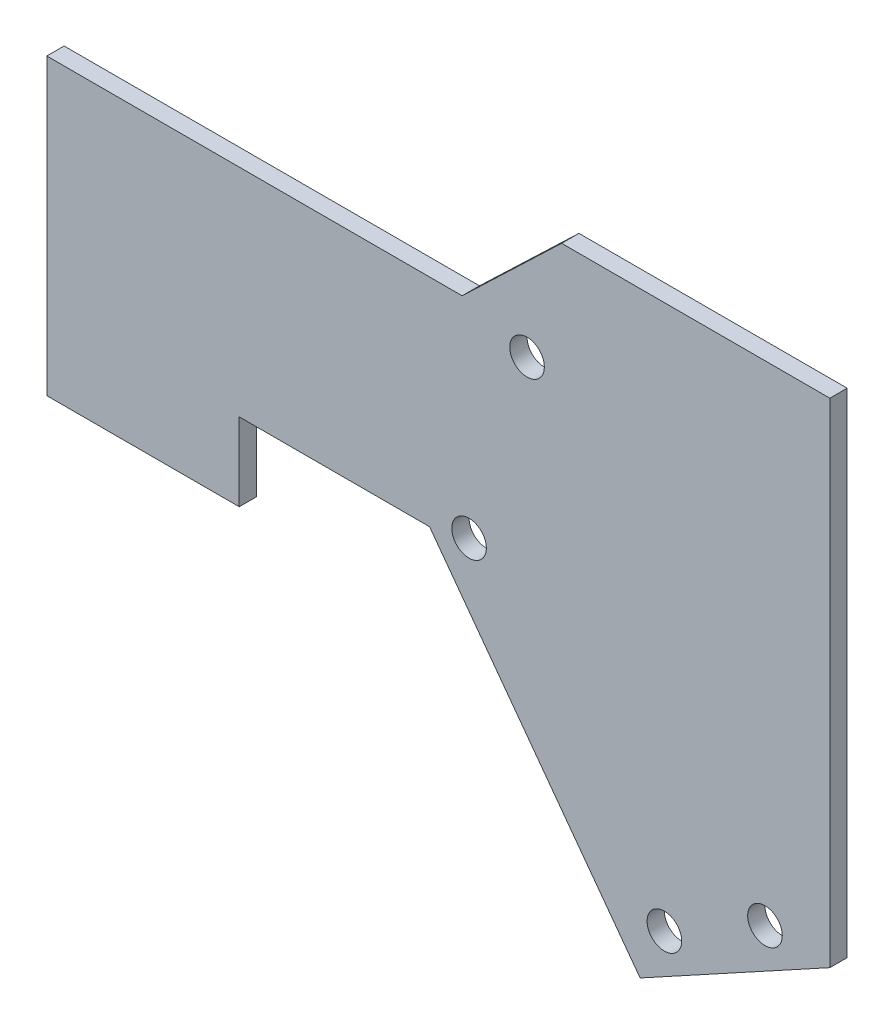
ISO-10303-21;
HEADER;
FILE_DESCRIPTION(('STEP AP214'),'2;1');
FILE_NAME('part.step','',(''),(''),'','','');
FILE_SCHEMA(('AUTOMOTIVE_DESIGN { 1 0 10303 214 1 1 1 1 }'));
ENDSEC;
DATA;
#1=APPLICATION_CONTEXT('core data for automotive mechanical design processes');
#2=APPLICATION_PROTOCOL_DEFINITION('international standard','automotive_design',2000,#1);
#3=PRODUCT_CONTEXT('',#1,'mechanical');
#4=PRODUCT('Part','Part','',(#3));
#5=PRODUCT_RELATED_PRODUCT_CATEGORY('part','',(#4));
#6=PRODUCT_DEFINITION_FORMATION('','',#4);
#7=PRODUCT_DEFINITION_CONTEXT('part definition',#1,'design');
#8=PRODUCT_DEFINITION('design','',#6,#7);
#9=PRODUCT_DEFINITION_SHAPE('','',#8);
#10=(LENGTH_UNIT() NAMED_UNIT(*) SI_UNIT(.MILLI.,.METRE.));
#11=(NAMED_UNIT(*) PLANE_ANGLE_UNIT() SI_UNIT($,.RADIAN.));
#12=(NAMED_UNIT(*) SI_UNIT($,.STERADIAN.) SOLID_ANGLE_UNIT());
#13=UNCERTAINTY_MEASURE_WITH_UNIT(LENGTH_MEASURE(1.E-05),#10,'distance_accuracy_value','');
#14=(GEOMETRIC_REPRESENTATION_CONTEXT(3) GLOBAL_UNCERTAINTY_ASSIGNED_CONTEXT((#13)) GLOBAL_UNIT_ASSIGNED_CONTEXT((#10,
#11,#12)) REPRESENTATION_CONTEXT('',''));
#15=CARTESIAN_POINT('',(0.,0.,0.));
#16=DIRECTION('',(0.,0.,1.));
#17=DIRECTION('',(1.,0.,0.));
#18=AXIS2_PLACEMENT_3D('',#15,#16,#17);
#19=CARTESIAN_POINT('',(0.,0.,12.7));
#20=DIRECTION('',(0.,0.,1.));
#21=DIRECTION('',(1.,0.,0.));
#22=AXIS2_PLACEMENT_3D('',#19,#20,#21);
#23=PLANE('',#22);
#24=CARTESIAN_POINT('',(-264.814763389937,-221.394191571343,12.7));
#25=DIRECTION('',(0.,0.,1.));
#26=DIRECTION('',(1.,0.,0.));
#27=AXIS2_PLACEMENT_3D('',#24,#25,#26);
#28=CIRCLE('',#27,12.7);
#29=CARTESIAN_POINT('',(-252.114763389937,-221.394191571343,12.7));
#30=VERTEX_POINT('',#29);
#31=EDGE_CURVE('E218',#30,#30,#28,.T.);
#32=ORIENTED_EDGE('',*,*,#31,.F.);
#33=EDGE_LOOP('',(#32));
#34=FACE_BOUND('',#33,.T.);
#35=CARTESIAN_POINT('',(-121.436177407287,-399.440649221069,12.7));
#36=DIRECTION('',(0.,0.,1.));
#37=DIRECTION('',(1.,0.,0.));
#38=AXIS2_PLACEMENT_3D('',#35,#36,#37);
#39=CIRCLE('',#38,12.7);
#40=CARTESIAN_POINT('',(-108.736177407287,-399.440649221069,12.7));
#41=VERTEX_POINT('',#40);
#42=EDGE_CURVE('E146',#41,#41,#39,.T.);
#43=ORIENTED_EDGE('',*,*,#42,.F.);
#44=EDGE_LOOP('',(#43));
#45=FACE_BOUND('',#44,.T.);
#46=DIRECTION('',(-1.,0.,0.));
#47=VECTOR('',#46,1.);
#48=CARTESIAN_POINT('',(0.,0.,12.7));
#49=LINE('',#48,#47);
#50=CARTESIAN_POINT('',(0.,0.,12.7));
#51=VERTEX_POINT('',#50);
#52=CARTESIAN_POINT('',(-196.85,0.,12.7));
#53=VERTEX_POINT('',#52);
#54=EDGE_CURVE('E161',#51,#53,#49,.T.);
#55=ORIENTED_EDGE('',*,*,#54,.T.);
#56=DIRECTION('',(-0.722641857147699,-0.691222645967365,0.));
#57=VECTOR('',#56,1.);
#58=CARTESIAN_POINT('',(-196.85,0.,12.7));
#59=LINE('',#58,#57);
#60=CARTESIAN_POINT('',(-269.875,-69.85,12.7));
#61=VERTEX_POINT('',#60);
#62=EDGE_CURVE('E99',#53,#61,#59,.T.);
#63=ORIENTED_EDGE('',*,*,#62,.T.);
#64=DIRECTION('',(-1.,0.,0.));
#65=VECTOR('',#64,1.);
#66=CARTESIAN_POINT('',(-269.875,-69.85,12.7));
#67=LINE('',#66,#65);
#68=CARTESIAN_POINT('',(-574.675,-69.8500000000001,12.7));
#69=VERTEX_POINT('',#68);
#70=EDGE_CURVE('E182',#61,#69,#67,.T.);
#71=ORIENTED_EDGE('',*,*,#70,.T.);
#72=DIRECTION('',(0.,-1.,0.));
#73=VECTOR('',#72,1.);
#74=CARTESIAN_POINT('',(-574.675,-69.8500000000001,12.7));
#75=LINE('',#74,#73);
#76=CARTESIAN_POINT('',(-574.675,-285.75,12.7));
#77=VERTEX_POINT('',#76);
#78=EDGE_CURVE('E201',#69,#77,#75,.T.);
#79=ORIENTED_EDGE('',*,*,#78,.T.);
#80=DIRECTION('',(1.,0.,0.));
#81=VECTOR('',#80,1.);
#82=CARTESIAN_POINT('',(-433.468540736154,-285.75,12.7));
#83=LINE('',#82,#81);
#84=CARTESIAN_POINT('',(-433.468540736154,-285.75,12.7));
#85=VERTEX_POINT('',#84);
#86=EDGE_CURVE('E198',#77,#85,#83,.T.);
#87=ORIENTED_EDGE('',*,*,#86,.T.);
#88=DIRECTION('',(0.,1.,0.));
#89=VECTOR('',#88,1.);
#90=CARTESIAN_POINT('',(-433.468540736154,-228.6,12.7));
#91=LINE('',#90,#89);
#92=CARTESIAN_POINT('',(-433.468540736154,-228.6,12.7));
#93=VERTEX_POINT('',#92);
#94=EDGE_CURVE('E200',#85,#93,#91,.T.);
#95=ORIENTED_EDGE('',*,*,#94,.T.);
#96=DIRECTION('',(1.,0.,0.));
#97=VECTOR('',#96,1.);
#98=CARTESIAN_POINT('',(-293.768540736154,-228.6,12.7));
#99=LINE('',#98,#97);
#100=CARTESIAN_POINT('',(-293.768540736154,-228.6,12.7));
#101=VERTEX_POINT('',#100);
#102=EDGE_CURVE('E124',#93,#101,#99,.T.);
#103=ORIENTED_EDGE('',*,*,#102,.T.);
#104=DIRECTION('',(0.593440246858363,-0.804878048780488,0.));
#105=VECTOR('',#104,1.);
#106=CARTESIAN_POINT('',(-139.266372466579,-438.15,12.7));
#107=LINE('',#106,#105);
#108=CARTESIAN_POINT('',(-139.266372466579,-438.15,12.7));
#109=VERTEX_POINT('',#108);
#110=EDGE_CURVE('E118',#101,#109,#107,.T.);
#111=ORIENTED_EDGE('',*,*,#110,.T.);
#112=DIRECTION('',(0.877268487978452,0.48,0.));
#113=VECTOR('',#112,1.);
#114=CARTESIAN_POINT('',(0.,-361.95,12.7));
#115=LINE('',#114,#113);
#116=CARTESIAN_POINT('',(0.,-361.95,12.7));
#117=VERTEX_POINT('',#116);
#118=EDGE_CURVE('E122',#109,#117,#115,.T.);
#119=ORIENTED_EDGE('',*,*,#118,.T.);
#120=DIRECTION('',(0.,1.,0.));
#121=VECTOR('',#120,1.);
#122=CARTESIAN_POINT('',(0.,0.,12.7));
#123=LINE('',#122,#121);
#124=EDGE_CURVE('E50',#117,#51,#123,.T.);
#125=ORIENTED_EDGE('',*,*,#124,.T.);
#126=EDGE_LOOP('',(#55,#63,#71,#79,#87,#95,#103,#111,#119,#125));
#127=FACE_BOUND('',#126,.T.);
#128=CARTESIAN_POINT('',(-47.625,-359.054649221069,12.7));
#129=DIRECTION('',(0.,0.,1.));
#130=DIRECTION('',(1.,0.,0.));
#131=AXIS2_PLACEMENT_3D('',#128,#129,#130);
#132=CIRCLE('',#131,12.7000000000003);
#133=CARTESIAN_POINT('',(-34.9249999999996,-359.054649221069,12.7));
#134=VERTEX_POINT('',#133);
#135=EDGE_CURVE('E212',#134,#134,#132,.T.);
#136=ORIENTED_EDGE('',*,*,#135,.F.);
#137=EDGE_LOOP('',(#136));
#138=FACE_BOUND('',#137,.T.);
#139=CARTESIAN_POINT('',(-222.25,-85.0068514603241,12.7));
#140=DIRECTION('',(0.,0.,1.));
#141=DIRECTION('',(1.,0.,0.));
#142=AXIS2_PLACEMENT_3D('',#139,#140,#141);
#143=CIRCLE('',#142,12.7);
#144=CARTESIAN_POINT('',(-209.55,-85.0068514603241,12.7));
#145=VERTEX_POINT('',#144);
#146=EDGE_CURVE('E224',#145,#145,#143,.T.);
#147=ORIENTED_EDGE('',*,*,#146,.F.);
#148=EDGE_LOOP('',(#147));
#149=FACE_BOUND('',#148,.T.);
#150=ADVANCED_FACE('F33',(#34,#45,#127,#138,#149),#23,.T.);
#151=CARTESIAN_POINT('',(0.,0.,0.));
#152=DIRECTION('',(0.,0.,1.));
#153=DIRECTION('',(1.,0.,0.));
#154=AXIS2_PLACEMENT_3D('',#151,#152,#153);
#155=PLANE('',#154);
#156=DIRECTION('',(-1.,0.,0.));
#157=VECTOR('',#156,1.);
#158=CARTESIAN_POINT('',(0.,0.,0.));
#159=LINE('',#158,#157);
#160=CARTESIAN_POINT('',(0.,0.,0.));
#161=VERTEX_POINT('',#160);
#162=CARTESIAN_POINT('',(-196.85,0.,0.));
#163=VERTEX_POINT('',#162);
#164=EDGE_CURVE('E142',#161,#163,#159,.T.);
#165=ORIENTED_EDGE('',*,*,#164,.F.);
#166=DIRECTION('',(0.,1.,0.));
#167=VECTOR('',#166,1.);
#168=CARTESIAN_POINT('',(0.,0.,0.));
#169=LINE('',#168,#167);
#170=CARTESIAN_POINT('',(0.,-361.95,0.));
#171=VERTEX_POINT('',#170);
#172=EDGE_CURVE('E91',#171,#161,#169,.T.);
#173=ORIENTED_EDGE('',*,*,#172,.F.);
#174=DIRECTION('',(0.877268487978452,0.48,0.));
#175=VECTOR('',#174,1.);
#176=CARTESIAN_POINT('',(0.,-361.95,0.));
#177=LINE('',#176,#175);
#178=CARTESIAN_POINT('',(-139.266372466579,-438.15,0.));
#179=VERTEX_POINT('',#178);
#180=EDGE_CURVE('E85',#179,#171,#177,.T.);
#181=ORIENTED_EDGE('',*,*,#180,.F.);
#182=DIRECTION('',(0.593440246858363,-0.804878048780488,0.));
#183=VECTOR('',#182,1.);
#184=CARTESIAN_POINT('',(-139.266372466579,-438.15,0.));
#185=LINE('',#184,#183);
#186=CARTESIAN_POINT('',(-293.768540736154,-228.6,0.));
#187=VERTEX_POINT('',#186);
#188=EDGE_CURVE('E132',#187,#179,#185,.T.);
#189=ORIENTED_EDGE('',*,*,#188,.F.);
#190=DIRECTION('',(1.,0.,0.));
#191=VECTOR('',#190,1.);
#192=CARTESIAN_POINT('',(-293.768540736154,-228.6,0.));
#193=LINE('',#192,#191);
#194=CARTESIAN_POINT('',(-433.468540736154,-228.6,0.));
#195=VERTEX_POINT('',#194);
#196=EDGE_CURVE('E156',#195,#187,#193,.T.);
#197=ORIENTED_EDGE('',*,*,#196,.F.);
#198=DIRECTION('',(0.,1.,0.));
#199=VECTOR('',#198,1.);
#200=CARTESIAN_POINT('',(-433.468540736154,-228.6,0.));
#201=LINE('',#200,#199);
#202=CARTESIAN_POINT('',(-433.468540736154,-285.75,0.));
#203=VERTEX_POINT('',#202);
#204=EDGE_CURVE('E154',#203,#195,#201,.T.);
#205=ORIENTED_EDGE('',*,*,#204,.F.);
#206=DIRECTION('',(1.,0.,0.));
#207=VECTOR('',#206,1.);
#208=CARTESIAN_POINT('',(-433.468540736154,-285.75,0.));
#209=LINE('',#208,#207);
#210=CARTESIAN_POINT('',(-574.675,-285.75,0.));
#211=VERTEX_POINT('',#210);
#212=EDGE_CURVE('E152',#211,#203,#209,.T.);
#213=ORIENTED_EDGE('',*,*,#212,.F.);
#214=DIRECTION('',(0.,-1.,0.));
#215=VECTOR('',#214,1.);
#216=CARTESIAN_POINT('',(-574.675,-69.8500000000001,0.));
#217=LINE('',#216,#215);
#218=CARTESIAN_POINT('',(-574.675,-69.8500000000001,0.));
#219=VERTEX_POINT('',#218);
#220=EDGE_CURVE('E150',#219,#211,#217,.T.);
#221=ORIENTED_EDGE('',*,*,#220,.F.);
#222=DIRECTION('',(-1.,0.,0.));
#223=VECTOR('',#222,1.);
#224=CARTESIAN_POINT('',(-269.875,-69.85,0.));
#225=LINE('',#224,#223);
#226=CARTESIAN_POINT('',(-269.875,-69.85,0.));
#227=VERTEX_POINT('',#226);
#228=EDGE_CURVE('E148',#227,#219,#225,.T.);
#229=ORIENTED_EDGE('',*,*,#228,.F.);
#230=DIRECTION('',(-0.722641857147699,-0.691222645967365,0.));
#231=VECTOR('',#230,1.);
#232=CARTESIAN_POINT('',(-196.85,0.,0.));
#233=LINE('',#232,#231);
#234=EDGE_CURVE('E145',#163,#227,#233,.T.);
#235=ORIENTED_EDGE('',*,*,#234,.F.);
#236=EDGE_LOOP('',(#165,#173,#181,#189,#197,#205,#213,#221,#229,#235));
#237=FACE_BOUND('',#236,.T.);
#238=CARTESIAN_POINT('',(-121.436177407287,-399.440649221069,0.));
#239=DIRECTION('',(0.,0.,1.));
#240=DIRECTION('',(1.,0.,0.));
#241=AXIS2_PLACEMENT_3D('',#238,#239,#240);
#242=CIRCLE('',#241,12.7);
#243=CARTESIAN_POINT('',(-108.736177407287,-399.440649221069,0.));
#244=VERTEX_POINT('',#243);
#245=EDGE_CURVE('E209',#244,#244,#242,.T.);
#246=ORIENTED_EDGE('',*,*,#245,.T.);
#247=EDGE_LOOP('',(#246));
#248=FACE_BOUND('',#247,.T.);
#249=CARTESIAN_POINT('',(-47.625,-359.054649221069,0.));
#250=DIRECTION('',(0.,0.,1.));
#251=DIRECTION('',(1.,0.,0.));
#252=AXIS2_PLACEMENT_3D('',#249,#250,#251);
#253=CIRCLE('',#252,12.7000000000003);
#254=CARTESIAN_POINT('',(-34.9249999999996,-359.054649221069,0.));
#255=VERTEX_POINT('',#254);
#256=EDGE_CURVE('E215',#255,#255,#253,.T.);
#257=ORIENTED_EDGE('',*,*,#256,.T.);
#258=EDGE_LOOP('',(#257));
#259=FACE_BOUND('',#258,.T.);
#260=CARTESIAN_POINT('',(-264.814763389937,-221.394191571343,0.));
#261=DIRECTION('',(0.,0.,1.));
#262=DIRECTION('',(1.,0.,0.));
#263=AXIS2_PLACEMENT_3D('',#260,#261,#262);
#264=CIRCLE('',#263,12.7);
#265=CARTESIAN_POINT('',(-252.114763389937,-221.394191571343,0.));
#266=VERTEX_POINT('',#265);
#267=EDGE_CURVE('E221',#266,#266,#264,.T.);
#268=ORIENTED_EDGE('',*,*,#267,.T.);
#269=EDGE_LOOP('',(#268));
#270=FACE_BOUND('',#269,.T.);
#271=CARTESIAN_POINT('',(-222.25,-85.0068514603241,0.));
#272=DIRECTION('',(0.,0.,1.));
#273=DIRECTION('',(1.,0.,0.));
#274=AXIS2_PLACEMENT_3D('',#271,#272,#273);
#275=CIRCLE('',#274,12.7);
#276=CARTESIAN_POINT('',(-209.55,-85.0068514603241,0.));
#277=VERTEX_POINT('',#276);
#278=EDGE_CURVE('E227',#277,#277,#275,.T.);
#279=ORIENTED_EDGE('',*,*,#278,.T.);
#280=EDGE_LOOP('',(#279));
#281=FACE_BOUND('',#280,.T.);
#282=ADVANCED_FACE('F186',(#237,#248,#259,#270,#281),#155,.F.);
#283=CARTESIAN_POINT('',(0.,0.,12.7));
#284=DIRECTION('',(0.,-1.,0.));
#285=DIRECTION('',(1.,0.,0.));
#286=AXIS2_PLACEMENT_3D('',#283,#284,#285);
#287=PLANE('',#286);
#288=ORIENTED_EDGE('',*,*,#164,.T.);
#289=DIRECTION('',(0.,0.,-1.));
#290=VECTOR('',#289,1.);
#291=CARTESIAN_POINT('',(-196.85,0.,12.7));
#292=LINE('',#291,#290);
#293=EDGE_CURVE('E11',#53,#163,#292,.T.);
#294=ORIENTED_EDGE('',*,*,#293,.F.);
#295=ORIENTED_EDGE('',*,*,#54,.F.);
#296=DIRECTION('',(0.,0.,-1.));
#297=VECTOR('',#296,1.);
#298=CARTESIAN_POINT('',(0.,0.,12.7));
#299=LINE('',#298,#297);
#300=EDGE_CURVE('E138',#51,#161,#299,.T.);
#301=ORIENTED_EDGE('',*,*,#300,.T.);
#302=EDGE_LOOP('',(#288,#294,#295,#301));
#303=FACE_BOUND('',#302,.T.);
#304=ADVANCED_FACE('F35',(#303),#287,.F.);
#305=CARTESIAN_POINT('',(-196.85,0.,12.7));
#306=DIRECTION('',(0.691222645967365,-0.722641857147699,0.));
#307=DIRECTION('',(0.722641857147699,0.691222645967365,0.));
#308=AXIS2_PLACEMENT_3D('',#305,#306,#307);
#309=PLANE('',#308);
#310=ORIENTED_EDGE('',*,*,#234,.T.);
#311=DIRECTION('',(0.,0.,-1.));
#312=VECTOR('',#311,1.);
#313=CARTESIAN_POINT('',(-269.875,-69.85,12.7));
#314=LINE('',#313,#312);
#315=EDGE_CURVE('E42',#61,#227,#314,.T.);
#316=ORIENTED_EDGE('',*,*,#315,.F.);
#317=ORIENTED_EDGE('',*,*,#62,.F.);
#318=ORIENTED_EDGE('',*,*,#293,.T.);
#319=EDGE_LOOP('',(#310,#316,#317,#318));
#320=FACE_BOUND('',#319,.T.);
#321=ADVANCED_FACE('F269',(#320),#309,.F.);
#322=CARTESIAN_POINT('',(-269.875,-69.85,12.7));
#323=DIRECTION('',(0.,-1.,0.));
#324=DIRECTION('',(1.,0.,0.));
#325=AXIS2_PLACEMENT_3D('',#322,#323,#324);
#326=PLANE('',#325);
#327=ORIENTED_EDGE('',*,*,#228,.T.);
#328=DIRECTION('',(0.,0.,-1.));
#329=VECTOR('',#328,1.);
#330=CARTESIAN_POINT('',(-574.675,-69.8500000000001,12.7));
#331=LINE('',#330,#329);
#332=EDGE_CURVE('E174',#69,#219,#331,.T.);
#333=ORIENTED_EDGE('',*,*,#332,.F.);
#334=ORIENTED_EDGE('',*,*,#70,.F.);
#335=ORIENTED_EDGE('',*,*,#315,.T.);
#336=EDGE_LOOP('',(#327,#333,#334,#335));
#337=FACE_BOUND('',#336,.T.);
#338=ADVANCED_FACE('F180',(#337),#326,.F.);
#339=CARTESIAN_POINT('',(-574.675,-69.8500000000001,12.7));
#340=DIRECTION('',(1.,0.,0.));
#341=DIRECTION('',(0.,1.,0.));
#342=AXIS2_PLACEMENT_3D('',#339,#340,#341);
#343=PLANE('',#342);
#344=ORIENTED_EDGE('',*,*,#220,.T.);
#345=DIRECTION('',(0.,0.,-1.));
#346=VECTOR('',#345,1.);
#347=CARTESIAN_POINT('',(-574.675,-285.75,12.7));
#348=LINE('',#347,#346);
#349=EDGE_CURVE('E171',#77,#211,#348,.T.);
#350=ORIENTED_EDGE('',*,*,#349,.F.);
#351=ORIENTED_EDGE('',*,*,#78,.F.);
#352=ORIENTED_EDGE('',*,*,#332,.T.);
#353=EDGE_LOOP('',(#344,#350,#351,#352));
#354=FACE_BOUND('',#353,.T.);
#355=ADVANCED_FACE('F192',(#354),#343,.F.);
#356=CARTESIAN_POINT('',(-433.468540736154,-285.75,12.7));
#357=DIRECTION('',(0.,1.,0.));
#358=DIRECTION('',(0.,0.,1.));
#359=AXIS2_PLACEMENT_3D('',#356,#357,#358);
#360=PLANE('',#359);
#361=ORIENTED_EDGE('',*,*,#212,.T.);
#362=DIRECTION('',(0.,0.,-1.));
#363=VECTOR('',#362,1.);
#364=CARTESIAN_POINT('',(-433.468540736154,-285.75,12.7));
#365=LINE('',#364,#363);
#366=EDGE_CURVE('E168',#85,#203,#365,.T.);
#367=ORIENTED_EDGE('',*,*,#366,.F.);
#368=ORIENTED_EDGE('',*,*,#86,.F.);
#369=ORIENTED_EDGE('',*,*,#349,.T.);
#370=EDGE_LOOP('',(#361,#367,#368,#369));
#371=FACE_BOUND('',#370,.T.);
#372=ADVANCED_FACE('F196',(#371),#360,.F.);
#373=CARTESIAN_POINT('',(-433.468540736154,-228.6,12.7));
#374=DIRECTION('',(-1.,0.,0.));
#375=DIRECTION('',(0.,0.,1.));
#376=AXIS2_PLACEMENT_3D('',#373,#374,#375);
#377=PLANE('',#376);
#378=ORIENTED_EDGE('',*,*,#204,.T.);
#379=DIRECTION('',(0.,0.,-1.));
#380=VECTOR('',#379,1.);
#381=CARTESIAN_POINT('',(-433.468540736154,-228.6,12.7));
#382=LINE('',#381,#380);
#383=EDGE_CURVE('E165',#93,#195,#382,.T.);
#384=ORIENTED_EDGE('',*,*,#383,.F.);
#385=ORIENTED_EDGE('',*,*,#94,.F.);
#386=ORIENTED_EDGE('',*,*,#366,.T.);
#387=EDGE_LOOP('',(#378,#384,#385,#386));
#388=FACE_BOUND('',#387,.T.);
#389=ADVANCED_FACE('F259',(#388),#377,.F.);
#390=CARTESIAN_POINT('',(-293.768540736154,-228.6,12.7));
#391=DIRECTION('',(0.,1.,0.));
#392=DIRECTION('',(-1.,0.,0.));
#393=AXIS2_PLACEMENT_3D('',#390,#391,#392);
#394=PLANE('',#393);
#395=ORIENTED_EDGE('',*,*,#196,.T.);
#396=DIRECTION('',(0.,0.,-1.));
#397=VECTOR('',#396,1.);
#398=CARTESIAN_POINT('',(-293.768540736154,-228.6,12.7));
#399=LINE('',#398,#397);
#400=EDGE_CURVE('E133',#101,#187,#399,.T.);
#401=ORIENTED_EDGE('',*,*,#400,.F.);
#402=ORIENTED_EDGE('',*,*,#102,.F.);
#403=ORIENTED_EDGE('',*,*,#383,.T.);
#404=EDGE_LOOP('',(#395,#401,#402,#403));
#405=FACE_BOUND('',#404,.T.);
#406=ADVANCED_FACE('F256',(#405),#394,.F.);
#407=CARTESIAN_POINT('',(-139.266372466579,-438.15,12.7));
#408=DIRECTION('',(0.804878048780488,0.593440246858363,0.));
#409=DIRECTION('',(-0.593440246858363,0.804878048780488,0.));
#410=AXIS2_PLACEMENT_3D('',#407,#408,#409);
#411=PLANE('',#410);
#412=ORIENTED_EDGE('',*,*,#188,.T.);
#413=DIRECTION('',(0.,0.,-1.));
#414=VECTOR('',#413,1.);
#415=CARTESIAN_POINT('',(-139.266372466579,-438.15,12.7));
#416=LINE('',#415,#414);
#417=EDGE_CURVE('E129',#109,#179,#416,.T.);
#418=ORIENTED_EDGE('',*,*,#417,.F.);
#419=ORIENTED_EDGE('',*,*,#110,.F.);
#420=ORIENTED_EDGE('',*,*,#400,.T.);
#421=EDGE_LOOP('',(#412,#418,#419,#420));
#422=FACE_BOUND('',#421,.T.);
#423=ADVANCED_FACE('F130',(#422),#411,.F.);
#424=CARTESIAN_POINT('',(0.,-361.95,12.7));
#425=DIRECTION('',(-0.48,0.877268487978452,0.));
#426=DIRECTION('',(-0.877268487978452,-0.48,0.));
#427=AXIS2_PLACEMENT_3D('',#424,#425,#426);
#428=PLANE('',#427);
#429=ORIENTED_EDGE('',*,*,#180,.T.);
#430=DIRECTION('',(0.,0.,-1.));
#431=VECTOR('',#430,1.);
#432=CARTESIAN_POINT('',(0.,-361.95,12.7));
#433=LINE('',#432,#431);
#434=EDGE_CURVE('E134',#117,#171,#433,.T.);
#435=ORIENTED_EDGE('',*,*,#434,.F.);
#436=ORIENTED_EDGE('',*,*,#118,.F.);
#437=ORIENTED_EDGE('',*,*,#417,.T.);
#438=EDGE_LOOP('',(#429,#435,#436,#437));
#439=FACE_BOUND('',#438,.T.);
#440=ADVANCED_FACE('F136',(#439),#428,.F.);
#441=CARTESIAN_POINT('',(0.,0.,12.7));
#442=DIRECTION('',(-1.,0.,0.));
#443=DIRECTION('',(0.,-1.,0.));
#444=AXIS2_PLACEMENT_3D('',#441,#442,#443);
#445=PLANE('',#444);
#446=ORIENTED_EDGE('',*,*,#172,.T.);
#447=ORIENTED_EDGE('',*,*,#300,.F.);
#448=ORIENTED_EDGE('',*,*,#124,.F.);
#449=ORIENTED_EDGE('',*,*,#434,.T.);
#450=EDGE_LOOP('',(#446,#447,#448,#449));
#451=FACE_BOUND('',#450,.T.);
#452=ADVANCED_FACE('F249',(#451),#445,.F.);
#453=CARTESIAN_POINT('',(-121.436177407287,-399.440649221069,12.7));
#454=DIRECTION('',(0.,0.,-1.));
#455=DIRECTION('',(-1.,0.,0.));
#456=AXIS2_PLACEMENT_3D('',#453,#454,#455);
#457=CYLINDRICAL_SURFACE('',#456,12.7);
#458=ORIENTED_EDGE('',*,*,#42,.T.);
#459=EDGE_LOOP('',(#458));
#460=FACE_BOUND('',#459,.T.);
#461=ORIENTED_EDGE('',*,*,#245,.F.);
#462=EDGE_LOOP('',(#461));
#463=FACE_BOUND('',#462,.T.);
#464=ADVANCED_FACE('F246',(#460,#463),#457,.F.);
#465=CARTESIAN_POINT('',(-47.625,-359.054649221069,12.7));
#466=DIRECTION('',(0.,0.,-1.));
#467=DIRECTION('',(-1.,0.,0.));
#468=AXIS2_PLACEMENT_3D('',#465,#466,#467);
#469=CYLINDRICAL_SURFACE('',#468,12.7000000000003);
#470=ORIENTED_EDGE('',*,*,#135,.T.);
#471=EDGE_LOOP('',(#470));
#472=FACE_BOUND('',#471,.T.);
#473=ORIENTED_EDGE('',*,*,#256,.F.);
#474=EDGE_LOOP('',(#473));
#475=FACE_BOUND('',#474,.T.);
#476=ADVANCED_FACE('F345',(#472,#475),#469,.F.);
#477=CARTESIAN_POINT('',(-264.814763389937,-221.394191571343,12.7));
#478=DIRECTION('',(0.,0.,-1.));
#479=DIRECTION('',(-1.,0.,0.));
#480=AXIS2_PLACEMENT_3D('',#477,#478,#479);
#481=CYLINDRICAL_SURFACE('',#480,12.7);
#482=ORIENTED_EDGE('',*,*,#31,.T.);
#483=EDGE_LOOP('',(#482));
#484=FACE_BOUND('',#483,.T.);
#485=ORIENTED_EDGE('',*,*,#267,.F.);
#486=EDGE_LOOP('',(#485));
#487=FACE_BOUND('',#486,.T.);
#488=ADVANCED_FACE('F353',(#484,#487),#481,.F.);
#489=CARTESIAN_POINT('',(-222.25,-85.0068514603241,12.7));
#490=DIRECTION('',(0.,0.,-1.));
#491=DIRECTION('',(-1.,0.,0.));
#492=AXIS2_PLACEMENT_3D('',#489,#490,#491);
#493=CYLINDRICAL_SURFACE('',#492,12.7);
#494=ORIENTED_EDGE('',*,*,#146,.T.);
#495=EDGE_LOOP('',(#494));
#496=FACE_BOUND('',#495,.T.);
#497=ORIENTED_EDGE('',*,*,#278,.F.);
#498=EDGE_LOOP('',(#497));
#499=FACE_BOUND('',#498,.T.);
#500=ADVANCED_FACE('F233',(#496,#499),#493,.F.);
#501=CLOSED_SHELL('',(#150,#282,#304,#321,#338,#355,#372,#389,#406,#423,#440,#452,#464,#476,
#488,#500));
#502=MANIFOLD_SOLID_BREP('B2',#501);
#503=ADVANCED_BREP_SHAPE_REPRESENTATION('',(#18,#502),#14);
#504=SHAPE_DEFINITION_REPRESENTATION(#9,#503);
ENDSEC;
END-ISO-10303-21;
